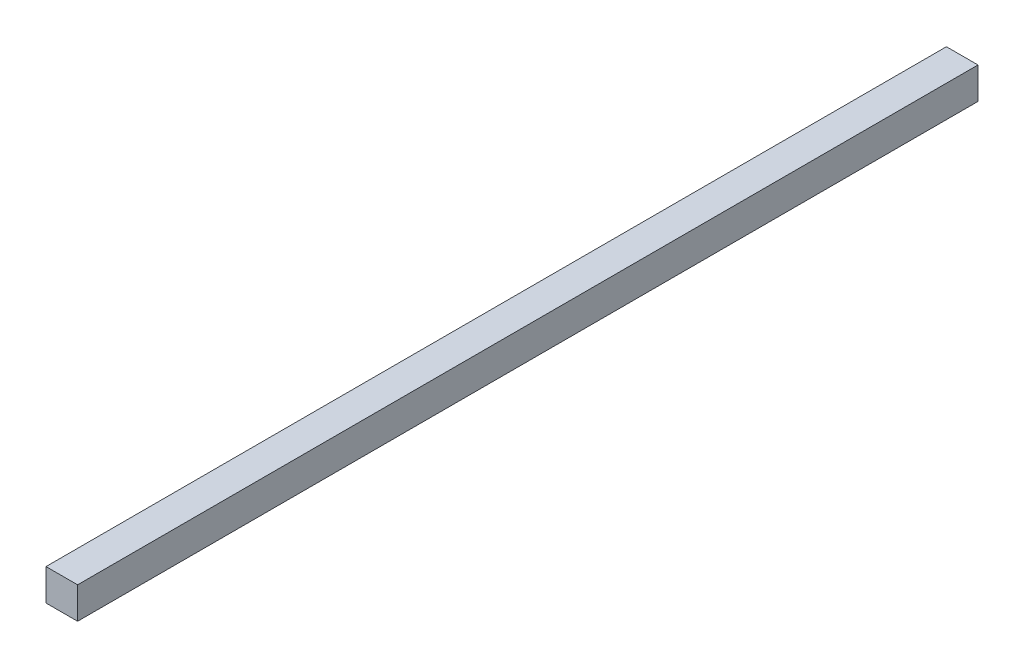
ISO-10303-21;
HEADER;
FILE_DESCRIPTION(('STEP AP214'),'2;1');
FILE_NAME('part.step','',(''),(''),'','','');
FILE_SCHEMA(('AUTOMOTIVE_DESIGN { 1 0 10303 214 1 1 1 1 }'));
ENDSEC;
DATA;
#1=APPLICATION_CONTEXT('core data for automotive mechanical design processes');
#2=APPLICATION_PROTOCOL_DEFINITION('international standard','automotive_design',2000,#1);
#3=PRODUCT_CONTEXT('',#1,'mechanical');
#4=PRODUCT('Part','Part','',(#3));
#5=PRODUCT_RELATED_PRODUCT_CATEGORY('part','',(#4));
#6=PRODUCT_DEFINITION_FORMATION('','',#4);
#7=PRODUCT_DEFINITION_CONTEXT('part definition',#1,'design');
#8=PRODUCT_DEFINITION('design','',#6,#7);
#9=PRODUCT_DEFINITION_SHAPE('','',#8);
#10=(LENGTH_UNIT() NAMED_UNIT(*) SI_UNIT(.MILLI.,.METRE.));
#11=(NAMED_UNIT(*) PLANE_ANGLE_UNIT() SI_UNIT($,.RADIAN.));
#12=(NAMED_UNIT(*) SI_UNIT($,.STERADIAN.) SOLID_ANGLE_UNIT());
#13=UNCERTAINTY_MEASURE_WITH_UNIT(LENGTH_MEASURE(1.E-05),#10,'distance_accuracy_value','');
#14=(GEOMETRIC_REPRESENTATION_CONTEXT(3) GLOBAL_UNCERTAINTY_ASSIGNED_CONTEXT((#13)) GLOBAL_UNIT_ASSIGNED_CONTEXT((#10,
#11,#12)) REPRESENTATION_CONTEXT('',''));
#15=CARTESIAN_POINT('',(0.,0.,0.));
#16=DIRECTION('',(0.,0.,1.));
#17=DIRECTION('',(1.,0.,0.));
#18=AXIS2_PLACEMENT_3D('',#15,#16,#17);
#19=CARTESIAN_POINT('',(10.,20.,285.));
#20=DIRECTION('',(-1.,0.,0.));
#21=DIRECTION('',(0.,0.,1.));
#22=AXIS2_PLACEMENT_3D('',#19,#20,#21);
#23=PLANE('',#22);
#24=DIRECTION('',(0.,0.,-1.));
#25=VECTOR('',#24,1.);
#26=CARTESIAN_POINT('',(10.,0.,285.));
#27=LINE('',#26,#25);
#28=CARTESIAN_POINT('',(10.,0.,285.));
#29=VERTEX_POINT('',#28);
#30=CARTESIAN_POINT('',(10.,0.,-285.));
#31=VERTEX_POINT('',#30);
#32=EDGE_CURVE('E97',#29,#31,#27,.T.);
#33=ORIENTED_EDGE('',*,*,#32,.T.);
#34=DIRECTION('',(0.,-1.,0.));
#35=VECTOR('',#34,1.);
#36=CARTESIAN_POINT('',(10.,20.,-285.));
#37=LINE('',#36,#35);
#38=CARTESIAN_POINT('',(10.,20.,-285.));
#39=VERTEX_POINT('',#38);
#40=EDGE_CURVE('E11',#39,#31,#37,.T.);
#41=ORIENTED_EDGE('',*,*,#40,.F.);
#42=DIRECTION('',(0.,0.,-1.));
#43=VECTOR('',#42,1.);
#44=CARTESIAN_POINT('',(10.,20.,285.));
#45=LINE('',#44,#43);
#46=CARTESIAN_POINT('',(10.,20.,285.));
#47=VERTEX_POINT('',#46);
#48=EDGE_CURVE('E85',#47,#39,#45,.T.);
#49=ORIENTED_EDGE('',*,*,#48,.F.);
#50=DIRECTION('',(0.,-1.,0.));
#51=VECTOR('',#50,1.);
#52=CARTESIAN_POINT('',(10.,20.,285.));
#53=LINE('',#52,#51);
#54=EDGE_CURVE('E93',#47,#29,#53,.T.);
#55=ORIENTED_EDGE('',*,*,#54,.T.);
#56=EDGE_LOOP('',(#33,#41,#49,#55));
#57=FACE_BOUND('',#56,.T.);
#58=ADVANCED_FACE('F34',(#57),#23,.F.);
#59=CARTESIAN_POINT('',(-10.,20.,-285.));
#60=DIRECTION('',(0.,0.,1.));
#61=DIRECTION('',(1.,0.,0.));
#62=AXIS2_PLACEMENT_3D('',#59,#60,#61);
#63=PLANE('',#62);
#64=DIRECTION('',(-1.,0.,0.));
#65=VECTOR('',#64,1.);
#66=CARTESIAN_POINT('',(-10.,0.,-285.));
#67=LINE('',#66,#65);
#68=CARTESIAN_POINT('',(-10.,0.,-285.));
#69=VERTEX_POINT('',#68);
#70=EDGE_CURVE('E89',#31,#69,#67,.T.);
#71=ORIENTED_EDGE('',*,*,#70,.T.);
#72=DIRECTION('',(0.,-1.,0.));
#73=VECTOR('',#72,1.);
#74=CARTESIAN_POINT('',(-10.,20.,-285.));
#75=LINE('',#74,#73);
#76=CARTESIAN_POINT('',(-10.,20.,-285.));
#77=VERTEX_POINT('',#76);
#78=EDGE_CURVE('E42',#77,#69,#75,.T.);
#79=ORIENTED_EDGE('',*,*,#78,.F.);
#80=DIRECTION('',(-1.,0.,0.));
#81=VECTOR('',#80,1.);
#82=CARTESIAN_POINT('',(-10.,20.,-285.));
#83=LINE('',#82,#81);
#84=EDGE_CURVE('E80',#39,#77,#83,.T.);
#85=ORIENTED_EDGE('',*,*,#84,.F.);
#86=ORIENTED_EDGE('',*,*,#40,.T.);
#87=EDGE_LOOP('',(#71,#79,#85,#86));
#88=FACE_BOUND('',#87,.T.);
#89=ADVANCED_FACE('F88',(#88),#63,.F.);
#90=CARTESIAN_POINT('',(-10.,20.,285.));
#91=DIRECTION('',(1.,0.,0.));
#92=DIRECTION('',(0.,0.,-1.));
#93=AXIS2_PLACEMENT_3D('',#90,#91,#92);
#94=PLANE('',#93);
#95=DIRECTION('',(0.,0.,1.));
#96=VECTOR('',#95,1.);
#97=CARTESIAN_POINT('',(-10.,0.,285.));
#98=LINE('',#97,#96);
#99=CARTESIAN_POINT('',(-10.,0.,285.));
#100=VERTEX_POINT('',#99);
#101=EDGE_CURVE('E67',#69,#100,#98,.T.);
#102=ORIENTED_EDGE('',*,*,#101,.T.);
#103=DIRECTION('',(0.,-1.,0.));
#104=VECTOR('',#103,1.);
#105=CARTESIAN_POINT('',(-10.,20.,285.));
#106=LINE('',#105,#104);
#107=CARTESIAN_POINT('',(-10.,20.,285.));
#108=VERTEX_POINT('',#107);
#109=EDGE_CURVE('E90',#108,#100,#106,.T.);
#110=ORIENTED_EDGE('',*,*,#109,.F.);
#111=DIRECTION('',(0.,0.,1.));
#112=VECTOR('',#111,1.);
#113=CARTESIAN_POINT('',(-10.,20.,285.));
#114=LINE('',#113,#112);
#115=EDGE_CURVE('E83',#77,#108,#114,.T.);
#116=ORIENTED_EDGE('',*,*,#115,.F.);
#117=ORIENTED_EDGE('',*,*,#78,.T.);
#118=EDGE_LOOP('',(#102,#110,#116,#117));
#119=FACE_BOUND('',#118,.T.);
#120=ADVANCED_FACE('F91',(#119),#94,.F.);
#121=CARTESIAN_POINT('',(-10.,20.,285.));
#122=DIRECTION('',(0.,0.,-1.));
#123=DIRECTION('',(-1.,0.,0.));
#124=AXIS2_PLACEMENT_3D('',#121,#122,#123);
#125=PLANE('',#124);
#126=DIRECTION('',(1.,0.,0.));
#127=VECTOR('',#126,1.);
#128=CARTESIAN_POINT('',(-10.,0.,285.));
#129=LINE('',#128,#127);
#130=EDGE_CURVE('E73',#100,#29,#129,.T.);
#131=ORIENTED_EDGE('',*,*,#130,.T.);
#132=ORIENTED_EDGE('',*,*,#54,.F.);
#133=DIRECTION('',(1.,0.,0.));
#134=VECTOR('',#133,1.);
#135=CARTESIAN_POINT('',(-10.,20.,285.));
#136=LINE('',#135,#134);
#137=EDGE_CURVE('E50',#108,#47,#136,.T.);
#138=ORIENTED_EDGE('',*,*,#137,.F.);
#139=ORIENTED_EDGE('',*,*,#109,.T.);
#140=EDGE_LOOP('',(#131,#132,#138,#139));
#141=FACE_BOUND('',#140,.T.);
#142=ADVANCED_FACE('F104',(#141),#125,.F.);
#143=CARTESIAN_POINT('',(0.,20.,0.));
#144=DIRECTION('',(0.,-1.,0.));
#145=DIRECTION('',(0.,0.,-1.));
#146=AXIS2_PLACEMENT_3D('',#143,#144,#145);
#147=PLANE('',#146);
#148=ORIENTED_EDGE('',*,*,#48,.T.);
#149=ORIENTED_EDGE('',*,*,#84,.T.);
#150=ORIENTED_EDGE('',*,*,#115,.T.);
#151=ORIENTED_EDGE('',*,*,#137,.T.);
#152=EDGE_LOOP('',(#148,#149,#150,#151));
#153=FACE_BOUND('',#152,.T.);
#154=ADVANCED_FACE('F81',(#153),#147,.F.);
#155=CARTESIAN_POINT('',(0.,0.,0.));
#156=DIRECTION('',(0.,-1.,0.));
#157=DIRECTION('',(0.,0.,-1.));
#158=AXIS2_PLACEMENT_3D('',#155,#156,#157);
#159=PLANE('',#158);
#160=ORIENTED_EDGE('',*,*,#32,.F.);
#161=ORIENTED_EDGE('',*,*,#130,.F.);
#162=ORIENTED_EDGE('',*,*,#101,.F.);
#163=ORIENTED_EDGE('',*,*,#70,.F.);
#164=EDGE_LOOP('',(#160,#161,#162,#163));
#165=FACE_BOUND('',#164,.T.);
#166=ADVANCED_FACE('F107',(#165),#159,.T.);
#167=CLOSED_SHELL('',(#58,#89,#120,#142,#154,#166));
#168=MANIFOLD_SOLID_BREP('B2',#167);
#169=ADVANCED_BREP_SHAPE_REPRESENTATION('',(#18,#168),#14);
#170=SHAPE_DEFINITION_REPRESENTATION(#9,#169);
ENDSEC;
END-ISO-10303-21;
